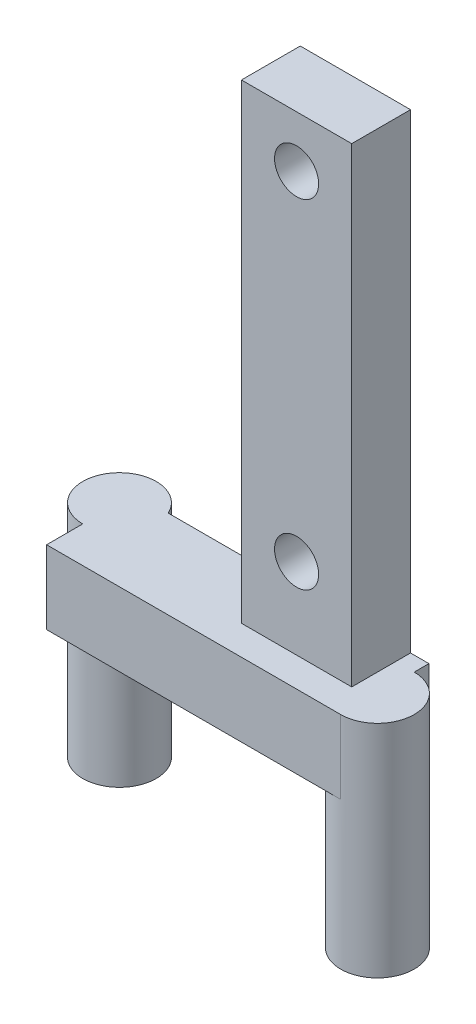
ISO-10303-21;
HEADER;
FILE_DESCRIPTION(('STEP AP214'),'2;1');
FILE_NAME('part.step','',(''),(''),'','','');
FILE_SCHEMA(('AUTOMOTIVE_DESIGN { 1 0 10303 214 1 1 1 1 }'));
ENDSEC;
DATA;
#1=APPLICATION_CONTEXT('core data for automotive mechanical design processes');
#2=APPLICATION_PROTOCOL_DEFINITION('international standard','automotive_design',2000,#1);
#3=PRODUCT_CONTEXT('',#1,'mechanical');
#4=PRODUCT('Part','Part','',(#3));
#5=PRODUCT_RELATED_PRODUCT_CATEGORY('part','',(#4));
#6=PRODUCT_DEFINITION_FORMATION('','',#4);
#7=PRODUCT_DEFINITION_CONTEXT('part definition',#1,'design');
#8=PRODUCT_DEFINITION('design','',#6,#7);
#9=PRODUCT_DEFINITION_SHAPE('','',#8);
#10=(LENGTH_UNIT() NAMED_UNIT(*) SI_UNIT(.MILLI.,.METRE.));
#11=(NAMED_UNIT(*) PLANE_ANGLE_UNIT() SI_UNIT($,.RADIAN.));
#12=(NAMED_UNIT(*) SI_UNIT($,.STERADIAN.) SOLID_ANGLE_UNIT());
#13=UNCERTAINTY_MEASURE_WITH_UNIT(LENGTH_MEASURE(1.E-05),#10,'distance_accuracy_value','');
#14=(GEOMETRIC_REPRESENTATION_CONTEXT(3) GLOBAL_UNCERTAINTY_ASSIGNED_CONTEXT((#13)) GLOBAL_UNIT_ASSIGNED_CONTEXT((#10,
#11,#12)) REPRESENTATION_CONTEXT('',''));
#15=CARTESIAN_POINT('',(0.,0.,0.));
#16=DIRECTION('',(0.,0.,1.));
#17=DIRECTION('',(1.,0.,0.));
#18=AXIS2_PLACEMENT_3D('',#15,#16,#17);
#19=CARTESIAN_POINT('',(0.,0.,0.));
#20=DIRECTION('',(0.,0.,1.));
#21=DIRECTION('',(1.,0.,0.));
#22=AXIS2_PLACEMENT_3D('',#19,#20,#21);
#23=PLANE('',#22);
#24=CARTESIAN_POINT('',(3.75,3.5,0.));
#25=DIRECTION('',(0.,0.,1.));
#26=DIRECTION('',(1.,0.,0.));
#27=AXIS2_PLACEMENT_3D('',#24,#25,#26);
#28=CIRCLE('',#27,1.5);
#29=CARTESIAN_POINT('',(5.25,3.5,0.));
#30=VERTEX_POINT('',#29);
#31=EDGE_CURVE('E153',#30,#30,#28,.T.);
#32=ORIENTED_EDGE('',*,*,#31,.T.);
#33=EDGE_LOOP('',(#32));
#34=FACE_BOUND('',#33,.T.);
#35=CARTESIAN_POINT('',(3.75,26.5,0.));
#36=DIRECTION('',(0.,0.,1.));
#37=DIRECTION('',(1.,0.,0.));
#38=AXIS2_PLACEMENT_3D('',#35,#36,#37);
#39=CIRCLE('',#38,1.5);
#40=CARTESIAN_POINT('',(5.25,26.5,0.));
#41=VERTEX_POINT('',#40);
#42=EDGE_CURVE('E157',#41,#41,#39,.T.);
#43=ORIENTED_EDGE('',*,*,#42,.T.);
#44=EDGE_LOOP('',(#43));
#45=FACE_BOUND('',#44,.T.);
#46=DIRECTION('',(0.,1.,0.));
#47=VECTOR('',#46,1.);
#48=CARTESIAN_POINT('',(-8.97856451380211,-17.,0.));
#49=LINE('',#48,#47);
#50=CARTESIAN_POINT('',(-8.97856451380211,-2.,0.));
#51=VERTEX_POINT('',#50);
#52=CARTESIAN_POINT('',(-8.97856451380211,-7.,0.));
#53=VERTEX_POINT('',#52);
#54=EDGE_CURVE('E55',#51,#53,#49,.F.);
#55=ORIENTED_EDGE('',*,*,#54,.F.);
#56=DIRECTION('',(1.,0.,0.));
#57=VECTOR('',#56,1.);
#58=CARTESIAN_POINT('',(8.75,-2.,0.));
#59=LINE('',#58,#57);
#60=CARTESIAN_POINT('',(0.,-2.,0.));
#61=VERTEX_POINT('',#60);
#62=EDGE_CURVE('E147',#51,#61,#59,.T.);
#63=ORIENTED_EDGE('',*,*,#62,.T.);
#64=DIRECTION('',(0.,-1.,0.));
#65=VECTOR('',#64,1.);
#66=CARTESIAN_POINT('',(0.,0.,0.));
#67=LINE('',#66,#65);
#68=CARTESIAN_POINT('',(0.,30.,0.));
#69=VERTEX_POINT('',#68);
#70=EDGE_CURVE('E169',#69,#61,#67,.T.);
#71=ORIENTED_EDGE('',*,*,#70,.F.);
#72=DIRECTION('',(-1.,0.,0.));
#73=VECTOR('',#72,1.);
#74=CARTESIAN_POINT('',(0.,30.,0.));
#75=LINE('',#74,#73);
#76=CARTESIAN_POINT('',(7.5,30.,0.));
#77=VERTEX_POINT('',#76);
#78=EDGE_CURVE('E178',#77,#69,#75,.T.);
#79=ORIENTED_EDGE('',*,*,#78,.F.);
#80=DIRECTION('',(0.,1.,0.));
#81=VECTOR('',#80,1.);
#82=CARTESIAN_POINT('',(7.5,0.,0.));
#83=LINE('',#82,#81);
#84=CARTESIAN_POINT('',(7.5,-2.,0.));
#85=VERTEX_POINT('',#84);
#86=EDGE_CURVE('E163',#85,#77,#83,.T.);
#87=ORIENTED_EDGE('',*,*,#86,.F.);
#88=CARTESIAN_POINT('',(8.75,-2.,0.));
#89=VERTEX_POINT('',#88);
#90=EDGE_CURVE('E139',#85,#89,#59,.T.);
#91=ORIENTED_EDGE('',*,*,#90,.T.);
#92=DIRECTION('',(0.,1.,0.));
#93=VECTOR('',#92,1.);
#94=CARTESIAN_POINT('',(8.75,-7.,0.));
#95=LINE('',#94,#93);
#96=CARTESIAN_POINT('',(8.75,-7.,0.));
#97=VERTEX_POINT('',#96);
#98=EDGE_CURVE('E136',#97,#89,#95,.T.);
#99=ORIENTED_EDGE('',*,*,#98,.F.);
#100=DIRECTION('',(1.,0.,0.));
#101=VECTOR('',#100,1.);
#102=CARTESIAN_POINT('',(8.75,-7.,0.));
#103=LINE('',#102,#101);
#104=EDGE_CURVE('E144',#53,#97,#103,.T.);
#105=ORIENTED_EDGE('',*,*,#104,.F.);
#106=EDGE_LOOP('',(#55,#63,#71,#79,#87,#91,#99,#105));
#107=FACE_BOUND('',#106,.T.);
#108=ADVANCED_FACE('F33',(#34,#45,#107),#23,.F.);
#109=CARTESIAN_POINT('',(-11.25,0.,0.));
#110=DIRECTION('',(1.,0.,0.));
#111=DIRECTION('',(0.,0.,-1.));
#112=AXIS2_PLACEMENT_3D('',#109,#110,#111);
#113=PLANE('',#112);
#114=DIRECTION('',(0.,1.,0.));
#115=VECTOR('',#114,1.);
#116=CARTESIAN_POINT('',(-11.25,-17.,3.5443087819419));
#117=LINE('',#116,#115);
#118=CARTESIAN_POINT('',(-11.25,-7.,3.54430878194189));
#119=VERTEX_POINT('',#118);
#120=CARTESIAN_POINT('',(-11.25,-2.,3.54430878194189));
#121=VERTEX_POINT('',#120);
#122=EDGE_CURVE('E11',#119,#121,#117,.T.);
#123=ORIENTED_EDGE('',*,*,#122,.F.);
#124=DIRECTION('',(0.,0.,1.));
#125=VECTOR('',#124,1.);
#126=CARTESIAN_POINT('',(-11.25,-7.,0.));
#127=LINE('',#126,#125);
#128=CARTESIAN_POINT('',(-11.25,-7.,6.));
#129=VERTEX_POINT('',#128);
#130=EDGE_CURVE('E121',#119,#129,#127,.T.);
#131=ORIENTED_EDGE('',*,*,#130,.T.);
#132=DIRECTION('',(0.,1.,0.));
#133=VECTOR('',#132,1.);
#134=CARTESIAN_POINT('',(-11.25,-7.,6.));
#135=LINE('',#134,#133);
#136=CARTESIAN_POINT('',(-11.25,-2.,6.));
#137=VERTEX_POINT('',#136);
#138=EDGE_CURVE('E141',#129,#137,#135,.T.);
#139=ORIENTED_EDGE('',*,*,#138,.T.);
#140=DIRECTION('',(0.,0.,-1.));
#141=VECTOR('',#140,1.);
#142=CARTESIAN_POINT('',(-11.25,-2.,0.));
#143=LINE('',#142,#141);
#144=EDGE_CURVE('E137',#137,#121,#143,.T.);
#145=ORIENTED_EDGE('',*,*,#144,.T.);
#146=EDGE_LOOP('',(#123,#131,#139,#145));
#147=FACE_BOUND('',#146,.T.);
#148=ADVANCED_FACE('F225',(#147),#113,.F.);
#149=CARTESIAN_POINT('',(8.75,-7.,0.));
#150=DIRECTION('',(-1.,0.,0.));
#151=DIRECTION('',(0.,0.,1.));
#152=AXIS2_PLACEMENT_3D('',#149,#150,#151);
#153=PLANE('',#152);
#154=DIRECTION('',(0.,1.,0.));
#155=VECTOR('',#154,1.);
#156=CARTESIAN_POINT('',(8.75,-17.,1.));
#157=LINE('',#156,#155);
#158=CARTESIAN_POINT('',(8.75,-7.,1.));
#159=VERTEX_POINT('',#158);
#160=CARTESIAN_POINT('',(8.75,-2.,1.));
#161=VERTEX_POINT('',#160);
#162=EDGE_CURVE('E110',#159,#161,#157,.T.);
#163=ORIENTED_EDGE('',*,*,#162,.F.);
#164=DIRECTION('',(0.,0.,1.));
#165=VECTOR('',#164,1.);
#166=CARTESIAN_POINT('',(8.75,-7.,0.));
#167=LINE('',#166,#165);
#168=EDGE_CURVE('E149',#97,#159,#167,.T.);
#169=ORIENTED_EDGE('',*,*,#168,.F.);
#170=ORIENTED_EDGE('',*,*,#98,.T.);
#171=DIRECTION('',(0.,0.,1.));
#172=VECTOR('',#171,1.);
#173=CARTESIAN_POINT('',(8.75,-2.,0.));
#174=LINE('',#173,#172);
#175=EDGE_CURVE('E127',#89,#161,#174,.T.);
#176=ORIENTED_EDGE('',*,*,#175,.T.);
#177=EDGE_LOOP('',(#163,#169,#170,#176));
#178=FACE_BOUND('',#177,.T.);
#179=ADVANCED_FACE('F134',(#178),#153,.F.);
#180=CARTESIAN_POINT('',(0.,0.,4.));
#181=DIRECTION('',(0.,0.,1.));
#182=DIRECTION('',(1.,0.,0.));
#183=AXIS2_PLACEMENT_3D('',#180,#181,#182);
#184=PLANE('',#183);
#185=CARTESIAN_POINT('',(3.75,26.5,4.));
#186=DIRECTION('',(0.,0.,1.));
#187=DIRECTION('',(1.,0.,0.));
#188=AXIS2_PLACEMENT_3D('',#185,#186,#187);
#189=CIRCLE('',#188,1.5);
#190=CARTESIAN_POINT('',(5.25,26.5,4.));
#191=VERTEX_POINT('',#190);
#192=EDGE_CURVE('E160',#191,#191,#189,.T.);
#193=ORIENTED_EDGE('',*,*,#192,.F.);
#194=EDGE_LOOP('',(#193));
#195=FACE_BOUND('',#194,.T.);
#196=DIRECTION('',(0.,-1.,0.));
#197=VECTOR('',#196,1.);
#198=CARTESIAN_POINT('',(0.,0.,4.));
#199=LINE('',#198,#197);
#200=CARTESIAN_POINT('',(0.,30.,4.));
#201=VERTEX_POINT('',#200);
#202=CARTESIAN_POINT('',(0.,-2.,4.));
#203=VERTEX_POINT('',#202);
#204=EDGE_CURVE('E166',#201,#203,#199,.T.);
#205=ORIENTED_EDGE('',*,*,#204,.T.);
#206=DIRECTION('',(1.,0.,0.));
#207=VECTOR('',#206,1.);
#208=CARTESIAN_POINT('',(0.,-2.,4.));
#209=LINE('',#208,#207);
#210=CARTESIAN_POINT('',(7.5,-2.,4.));
#211=VERTEX_POINT('',#210);
#212=EDGE_CURVE('E168',#203,#211,#209,.T.);
#213=ORIENTED_EDGE('',*,*,#212,.T.);
#214=DIRECTION('',(0.,1.,0.));
#215=VECTOR('',#214,1.);
#216=CARTESIAN_POINT('',(7.5,-2.,4.));
#217=LINE('',#216,#215);
#218=CARTESIAN_POINT('',(7.5,30.,4.));
#219=VERTEX_POINT('',#218);
#220=EDGE_CURVE('E171',#211,#219,#217,.T.);
#221=ORIENTED_EDGE('',*,*,#220,.T.);
#222=DIRECTION('',(-1.,0.,0.));
#223=VECTOR('',#222,1.);
#224=CARTESIAN_POINT('',(0.,30.,4.));
#225=LINE('',#224,#223);
#226=EDGE_CURVE('E173',#219,#201,#225,.T.);
#227=ORIENTED_EDGE('',*,*,#226,.T.);
#228=EDGE_LOOP('',(#205,#213,#221,#227));
#229=FACE_BOUND('',#228,.T.);
#230=CARTESIAN_POINT('',(3.75,3.5,4.));
#231=DIRECTION('',(0.,0.,1.));
#232=DIRECTION('',(1.,0.,0.));
#233=AXIS2_PLACEMENT_3D('',#230,#231,#232);
#234=CIRCLE('',#233,1.5);
#235=CARTESIAN_POINT('',(5.25,3.5,4.));
#236=VERTEX_POINT('',#235);
#237=EDGE_CURVE('E154',#236,#236,#234,.T.);
#238=ORIENTED_EDGE('',*,*,#237,.F.);
#239=EDGE_LOOP('',(#238));
#240=FACE_BOUND('',#239,.T.);
#241=ADVANCED_FACE('F254',(#195,#229,#240),#184,.T.);
#242=CARTESIAN_POINT('',(7.5,0.,4.));
#243=DIRECTION('',(-1.,0.,0.));
#244=DIRECTION('',(0.,0.,1.));
#245=AXIS2_PLACEMENT_3D('',#242,#243,#244);
#246=PLANE('',#245);
#247=ORIENTED_EDGE('',*,*,#86,.T.);
#248=DIRECTION('',(0.,0.,-1.));
#249=VECTOR('',#248,1.);
#250=CARTESIAN_POINT('',(7.5,30.,4.));
#251=LINE('',#250,#249);
#252=EDGE_CURVE('E184',#219,#77,#251,.T.);
#253=ORIENTED_EDGE('',*,*,#252,.F.);
#254=ORIENTED_EDGE('',*,*,#220,.F.);
#255=DIRECTION('',(0.,0.,-1.));
#256=VECTOR('',#255,1.);
#257=CARTESIAN_POINT('',(7.5,-2.,4.));
#258=LINE('',#257,#256);
#259=EDGE_CURVE('E187',#211,#85,#258,.T.);
#260=ORIENTED_EDGE('',*,*,#259,.T.);
#261=EDGE_LOOP('',(#247,#253,#254,#260));
#262=FACE_BOUND('',#261,.T.);
#263=ADVANCED_FACE('F35',(#262),#246,.F.);
#264=CARTESIAN_POINT('',(0.,30.,4.));
#265=DIRECTION('',(0.,-1.,0.));
#266=DIRECTION('',(0.,0.,-1.));
#267=AXIS2_PLACEMENT_3D('',#264,#265,#266);
#268=PLANE('',#267);
#269=ORIENTED_EDGE('',*,*,#78,.T.);
#270=DIRECTION('',(0.,0.,-1.));
#271=VECTOR('',#270,1.);
#272=CARTESIAN_POINT('',(0.,30.,4.));
#273=LINE('',#272,#271);
#274=EDGE_CURVE('E176',#201,#69,#273,.T.);
#275=ORIENTED_EDGE('',*,*,#274,.F.);
#276=ORIENTED_EDGE('',*,*,#226,.F.);
#277=ORIENTED_EDGE('',*,*,#252,.T.);
#278=EDGE_LOOP('',(#269,#275,#276,#277));
#279=FACE_BOUND('',#278,.T.);
#280=ADVANCED_FACE('F201',(#279),#268,.F.);
#281=CARTESIAN_POINT('',(0.,0.,4.));
#282=DIRECTION('',(1.,0.,0.));
#283=DIRECTION('',(0.,0.,-1.));
#284=AXIS2_PLACEMENT_3D('',#281,#282,#283);
#285=PLANE('',#284);
#286=ORIENTED_EDGE('',*,*,#70,.T.);
#287=DIRECTION('',(0.,0.,-1.));
#288=VECTOR('',#287,1.);
#289=CARTESIAN_POINT('',(0.,-2.,4.));
#290=LINE('',#289,#288);
#291=EDGE_CURVE('E41',#203,#61,#290,.T.);
#292=ORIENTED_EDGE('',*,*,#291,.F.);
#293=ORIENTED_EDGE('',*,*,#204,.F.);
#294=ORIENTED_EDGE('',*,*,#274,.T.);
#295=EDGE_LOOP('',(#286,#292,#293,#294));
#296=FACE_BOUND('',#295,.T.);
#297=ADVANCED_FACE('F195',(#296),#285,.F.);
#298=CARTESIAN_POINT('',(3.75,26.5,4.));
#299=DIRECTION('',(0.,0.,-1.));
#300=DIRECTION('',(-1.,0.,0.));
#301=AXIS2_PLACEMENT_3D('',#298,#299,#300);
#302=CYLINDRICAL_SURFACE('',#301,1.5);
#303=ORIENTED_EDGE('',*,*,#192,.T.);
#304=EDGE_LOOP('',(#303));
#305=FACE_BOUND('',#304,.T.);
#306=ORIENTED_EDGE('',*,*,#42,.F.);
#307=EDGE_LOOP('',(#306));
#308=FACE_BOUND('',#307,.T.);
#309=ADVANCED_FACE('F239',(#305,#308),#302,.F.);
#310=CARTESIAN_POINT('',(3.75,3.5,4.));
#311=DIRECTION('',(0.,0.,-1.));
#312=DIRECTION('',(-1.,0.,0.));
#313=AXIS2_PLACEMENT_3D('',#310,#311,#312);
#314=CYLINDRICAL_SURFACE('',#313,1.5);
#315=ORIENTED_EDGE('',*,*,#237,.T.);
#316=EDGE_LOOP('',(#315));
#317=FACE_BOUND('',#316,.T.);
#318=ORIENTED_EDGE('',*,*,#31,.F.);
#319=EDGE_LOOP('',(#318));
#320=FACE_BOUND('',#319,.T.);
#321=ADVANCED_FACE('F232',(#317,#320),#314,.F.);
#322=CARTESIAN_POINT('',(8.75,-7.,6.));
#323=DIRECTION('',(0.,0.,-1.));
#324=DIRECTION('',(-1.,0.,0.));
#325=AXIS2_PLACEMENT_3D('',#322,#323,#324);
#326=PLANE('',#325);
#327=DIRECTION('',(-1.,0.,0.));
#328=VECTOR('',#327,1.);
#329=CARTESIAN_POINT('',(8.75,-2.,6.));
#330=LINE('',#329,#328);
#331=CARTESIAN_POINT('',(8.75,-2.,6.));
#332=VERTEX_POINT('',#331);
#333=EDGE_CURVE('E129',#332,#137,#330,.T.);
#334=ORIENTED_EDGE('',*,*,#333,.T.);
#335=ORIENTED_EDGE('',*,*,#138,.F.);
#336=DIRECTION('',(-1.,0.,0.));
#337=VECTOR('',#336,1.);
#338=CARTESIAN_POINT('',(8.75,-7.,6.));
#339=LINE('',#338,#337);
#340=CARTESIAN_POINT('',(8.75,-7.,6.));
#341=VERTEX_POINT('',#340);
#342=EDGE_CURVE('E206',#341,#129,#339,.T.);
#343=ORIENTED_EDGE('',*,*,#342,.F.);
#344=DIRECTION('',(0.,1.,0.));
#345=VECTOR('',#344,1.);
#346=CARTESIAN_POINT('',(8.75,-7.,6.));
#347=LINE('',#346,#345);
#348=EDGE_CURVE('E151',#341,#332,#347,.T.);
#349=ORIENTED_EDGE('',*,*,#348,.T.);
#350=EDGE_LOOP('',(#334,#335,#343,#349));
#351=FACE_BOUND('',#350,.T.);
#352=ADVANCED_FACE('F230',(#351),#326,.F.);
#353=CARTESIAN_POINT('',(0.,-7.,0.));
#354=DIRECTION('',(0.,-1.,0.));
#355=DIRECTION('',(0.,0.,-1.));
#356=AXIS2_PLACEMENT_3D('',#353,#354,#355);
#357=PLANE('',#356);
#358=ORIENTED_EDGE('',*,*,#130,.F.);
#359=CARTESIAN_POINT('',(-11.25,-7.,1.04430878194189));
#360=DIRECTION('',(0.,-1.,0.));
#361=DIRECTION('',(0.,0.,-1.));
#362=AXIS2_PLACEMENT_3D('',#359,#360,#361);
#363=CIRCLE('',#362,2.5);
#364=EDGE_CURVE('E48',#119,#53,#363,.F.);
#365=ORIENTED_EDGE('',*,*,#364,.T.);
#366=ORIENTED_EDGE('',*,*,#104,.T.);
#367=ORIENTED_EDGE('',*,*,#168,.T.);
#368=CARTESIAN_POINT('',(8.75,-7.,3.5));
#369=DIRECTION('',(0.,-1.,0.));
#370=DIRECTION('',(0.,0.,-1.));
#371=AXIS2_PLACEMENT_3D('',#368,#369,#370);
#372=CIRCLE('',#371,2.5);
#373=EDGE_CURVE('E116',#159,#341,#372,.F.);
#374=ORIENTED_EDGE('',*,*,#373,.T.);
#375=ORIENTED_EDGE('',*,*,#342,.T.);
#376=EDGE_LOOP('',(#358,#365,#366,#367,#374,#375));
#377=FACE_BOUND('',#376,.T.);
#378=ADVANCED_FACE('F226',(#377),#357,.T.);
#379=CARTESIAN_POINT('',(0.,-2.,0.));
#380=DIRECTION('',(0.,-1.,0.));
#381=DIRECTION('',(0.,0.,-1.));
#382=AXIS2_PLACEMENT_3D('',#379,#380,#381);
#383=PLANE('',#382);
#384=ORIENTED_EDGE('',*,*,#62,.F.);
#385=CARTESIAN_POINT('',(-11.25,-2.,1.04430878194189));
#386=DIRECTION('',(0.,-1.,0.));
#387=DIRECTION('',(0.,0.,-1.));
#388=AXIS2_PLACEMENT_3D('',#385,#386,#387);
#389=CIRCLE('',#388,2.5);
#390=EDGE_CURVE('E221',#51,#121,#389,.F.);
#391=ORIENTED_EDGE('',*,*,#390,.T.);
#392=ORIENTED_EDGE('',*,*,#144,.F.);
#393=ORIENTED_EDGE('',*,*,#333,.F.);
#394=CARTESIAN_POINT('',(8.75,-2.,3.5));
#395=DIRECTION('',(0.,-1.,0.));
#396=DIRECTION('',(0.,0.,-1.));
#397=AXIS2_PLACEMENT_3D('',#394,#395,#396);
#398=CIRCLE('',#397,2.5);
#399=EDGE_CURVE('E113',#332,#161,#398,.F.);
#400=ORIENTED_EDGE('',*,*,#399,.T.);
#401=ORIENTED_EDGE('',*,*,#175,.F.);
#402=ORIENTED_EDGE('',*,*,#90,.F.);
#403=ORIENTED_EDGE('',*,*,#259,.F.);
#404=ORIENTED_EDGE('',*,*,#212,.F.);
#405=ORIENTED_EDGE('',*,*,#291,.T.);
#406=EDGE_LOOP('',(#384,#391,#392,#393,#400,#401,#402,#403,#404,#405));
#407=FACE_BOUND('',#406,.T.);
#408=ADVANCED_FACE('F125',(#407),#383,.F.);
#409=CARTESIAN_POINT('',(8.75,-17.,3.5));
#410=DIRECTION('',(0.,1.,0.));
#411=DIRECTION('',(0.,0.,1.));
#412=AXIS2_PLACEMENT_3D('',#409,#410,#411);
#413=CYLINDRICAL_SURFACE('',#412,2.5);
#414=CARTESIAN_POINT('',(8.75,-17.,3.5));
#415=DIRECTION('',(0.,-1.,0.));
#416=DIRECTION('',(0.,0.,-1.));
#417=AXIS2_PLACEMENT_3D('',#414,#415,#416);
#418=CIRCLE('',#417,2.5);
#419=CARTESIAN_POINT('',(8.75,-17.,1.));
#420=VERTEX_POINT('',#419);
#421=EDGE_CURVE('E131',#420,#420,#418,.T.);
#422=ORIENTED_EDGE('',*,*,#421,.F.);
#423=EDGE_LOOP('',(#422));
#424=FACE_BOUND('',#423,.T.);
#425=ORIENTED_EDGE('',*,*,#373,.F.);
#426=ORIENTED_EDGE('',*,*,#162,.T.);
#427=ORIENTED_EDGE('',*,*,#399,.F.);
#428=ORIENTED_EDGE('',*,*,#348,.F.);
#429=EDGE_LOOP('',(#425,#426,#427,#428));
#430=FACE_BOUND('',#429,.T.);
#431=ADVANCED_FACE('F112',(#424,#430),#413,.T.);
#432=CARTESIAN_POINT('',(8.75,-17.,3.5));
#433=DIRECTION('',(0.,-1.,0.));
#434=DIRECTION('',(0.,0.,-1.));
#435=AXIS2_PLACEMENT_3D('',#432,#433,#434);
#436=PLANE('',#435);
#437=ORIENTED_EDGE('',*,*,#421,.T.);
#438=EDGE_LOOP('',(#437));
#439=FACE_BOUND('',#438,.T.);
#440=ADVANCED_FACE('F350',(#439),#436,.T.);
#441=CARTESIAN_POINT('',(-11.25,-17.,1.04430878194189));
#442=DIRECTION('',(0.,1.,0.));
#443=DIRECTION('',(0.,0.,1.));
#444=AXIS2_PLACEMENT_3D('',#441,#442,#443);
#445=CYLINDRICAL_SURFACE('',#444,2.5);
#446=CARTESIAN_POINT('',(-11.25,-17.,1.04430878194189));
#447=DIRECTION('',(0.,-1.,0.));
#448=DIRECTION('',(0.,0.,-1.));
#449=AXIS2_PLACEMENT_3D('',#446,#447,#448);
#450=CIRCLE('',#449,2.5);
#451=CARTESIAN_POINT('',(-11.25,-17.,-1.45569121805811));
#452=VERTEX_POINT('',#451);
#453=EDGE_CURVE('E218',#452,#452,#450,.T.);
#454=ORIENTED_EDGE('',*,*,#453,.F.);
#455=EDGE_LOOP('',(#454));
#456=FACE_BOUND('',#455,.T.);
#457=ORIENTED_EDGE('',*,*,#390,.F.);
#458=ORIENTED_EDGE('',*,*,#54,.T.);
#459=ORIENTED_EDGE('',*,*,#364,.F.);
#460=ORIENTED_EDGE('',*,*,#122,.T.);
#461=EDGE_LOOP('',(#457,#458,#459,#460));
#462=FACE_BOUND('',#461,.T.);
#463=ADVANCED_FACE('F223',(#456,#462),#445,.T.);
#464=CARTESIAN_POINT('',(-11.25,-17.,1.04430878194189));
#465=DIRECTION('',(0.,-1.,0.));
#466=DIRECTION('',(0.,0.,-1.));
#467=AXIS2_PLACEMENT_3D('',#464,#465,#466);
#468=PLANE('',#467);
#469=ORIENTED_EDGE('',*,*,#453,.T.);
#470=EDGE_LOOP('',(#469));
#471=FACE_BOUND('',#470,.T.);
#472=ADVANCED_FACE('F369',(#471),#468,.T.);
#473=CLOSED_SHELL('',(#108,#148,#179,#241,#263,#280,#297,#309,#321,#352,#378,#408,#431,#440,
#463,#472));
#474=MANIFOLD_SOLID_BREP('B2',#473);
#475=ADVANCED_BREP_SHAPE_REPRESENTATION('',(#18,#474),#14);
#476=SHAPE_DEFINITION_REPRESENTATION(#9,#475);
ENDSEC;
END-ISO-10303-21;
